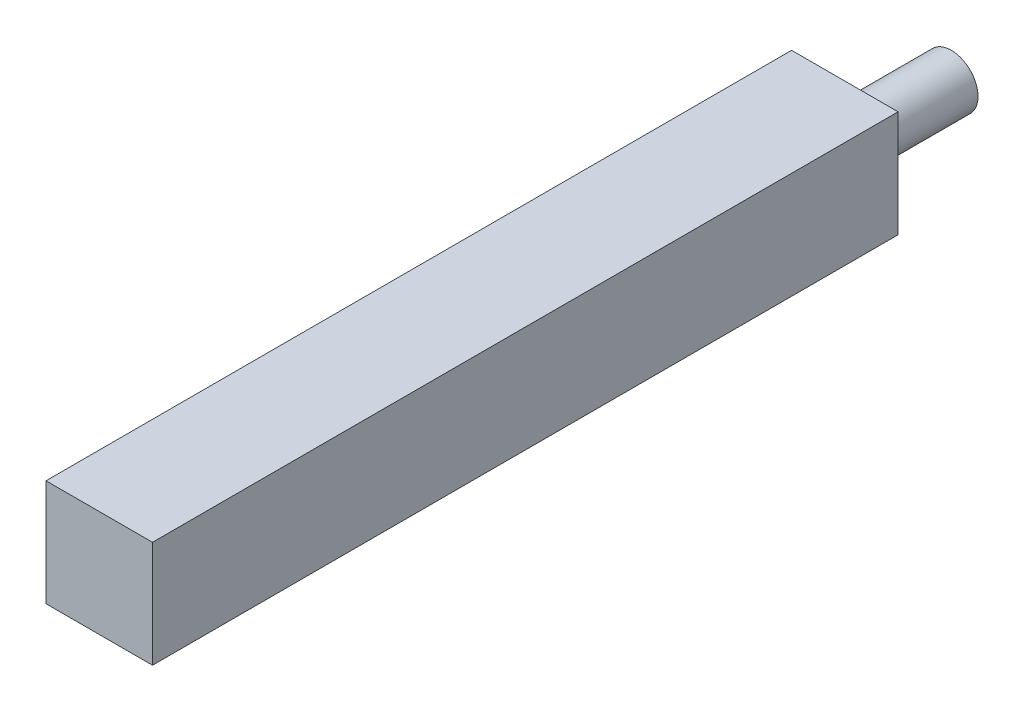
ISO-10303-21;
HEADER;
FILE_DESCRIPTION(('STEP AP214'),'2;1');
FILE_NAME('part.step','',(''),(''),'','','');
FILE_SCHEMA(('AUTOMOTIVE_DESIGN { 1 0 10303 214 1 1 1 1 }'));
ENDSEC;
DATA;
#1=APPLICATION_CONTEXT('core data for automotive mechanical design processes');
#2=APPLICATION_PROTOCOL_DEFINITION('international standard','automotive_design',2000,#1);
#3=PRODUCT_CONTEXT('',#1,'mechanical');
#4=PRODUCT('Part','Part','',(#3));
#5=PRODUCT_RELATED_PRODUCT_CATEGORY('part','',(#4));
#6=PRODUCT_DEFINITION_FORMATION('','',#4);
#7=PRODUCT_DEFINITION_CONTEXT('part definition',#1,'design');
#8=PRODUCT_DEFINITION('design','',#6,#7);
#9=PRODUCT_DEFINITION_SHAPE('','',#8);
#10=(LENGTH_UNIT() NAMED_UNIT(*) SI_UNIT(.MILLI.,.METRE.));
#11=(NAMED_UNIT(*) PLANE_ANGLE_UNIT() SI_UNIT($,.RADIAN.));
#12=(NAMED_UNIT(*) SI_UNIT($,.STERADIAN.) SOLID_ANGLE_UNIT());
#13=UNCERTAINTY_MEASURE_WITH_UNIT(LENGTH_MEASURE(1.E-05),#10,'distance_accuracy_value','');
#14=(GEOMETRIC_REPRESENTATION_CONTEXT(3) GLOBAL_UNCERTAINTY_ASSIGNED_CONTEXT((#13)) GLOBAL_UNIT_ASSIGNED_CONTEXT((#10,
#11,#12)) REPRESENTATION_CONTEXT('',''));
#15=CARTESIAN_POINT('',(0.,0.,0.));
#16=DIRECTION('',(0.,0.,1.));
#17=DIRECTION('',(1.,0.,0.));
#18=AXIS2_PLACEMENT_3D('',#15,#16,#17);
#19=CARTESIAN_POINT('',(0.,100.,700.));
#20=DIRECTION('',(1.,0.,0.));
#21=DIRECTION('',(0.,1.,0.));
#22=AXIS2_PLACEMENT_3D('',#19,#20,#21);
#23=PLANE('',#22);
#24=DIRECTION('',(0.,-1.,0.));
#25=VECTOR('',#24,1.);
#26=CARTESIAN_POINT('',(0.,100.,0.));
#27=LINE('',#26,#25);
#28=CARTESIAN_POINT('',(0.,100.,0.));
#29=VERTEX_POINT('',#28);
#30=CARTESIAN_POINT('',(0.,0.,0.));
#31=VERTEX_POINT('',#30);
#32=EDGE_CURVE('E113',#29,#31,#27,.T.);
#33=ORIENTED_EDGE('',*,*,#32,.T.);
#34=DIRECTION('',(0.,0.,-1.));
#35=VECTOR('',#34,1.);
#36=CARTESIAN_POINT('',(0.,0.,700.));
#37=LINE('',#36,#35);
#38=CARTESIAN_POINT('',(0.,0.,700.));
#39=VERTEX_POINT('',#38);
#40=EDGE_CURVE('E11',#39,#31,#37,.T.);
#41=ORIENTED_EDGE('',*,*,#40,.F.);
#42=DIRECTION('',(0.,-1.,0.));
#43=VECTOR('',#42,1.);
#44=CARTESIAN_POINT('',(0.,100.,700.));
#45=LINE('',#44,#43);
#46=CARTESIAN_POINT('',(0.,100.,700.));
#47=VERTEX_POINT('',#46);
#48=EDGE_CURVE('E97',#47,#39,#45,.T.);
#49=ORIENTED_EDGE('',*,*,#48,.F.);
#50=DIRECTION('',(0.,0.,-1.));
#51=VECTOR('',#50,1.);
#52=CARTESIAN_POINT('',(0.,100.,700.));
#53=LINE('',#52,#51);
#54=EDGE_CURVE('E109',#47,#29,#53,.T.);
#55=ORIENTED_EDGE('',*,*,#54,.T.);
#56=EDGE_LOOP('',(#33,#41,#49,#55));
#57=FACE_BOUND('',#56,.T.);
#58=ADVANCED_FACE('F45',(#57),#23,.F.);
#59=CARTESIAN_POINT('',(0.,0.,700.));
#60=DIRECTION('',(0.,1.,0.));
#61=DIRECTION('',(0.,0.,1.));
#62=AXIS2_PLACEMENT_3D('',#59,#60,#61);
#63=PLANE('',#62);
#64=DIRECTION('',(1.,0.,0.));
#65=VECTOR('',#64,1.);
#66=CARTESIAN_POINT('',(0.,0.,0.));
#67=LINE('',#66,#65);
#68=CARTESIAN_POINT('',(100.,0.,0.));
#69=VERTEX_POINT('',#68);
#70=EDGE_CURVE('E102',#31,#69,#67,.T.);
#71=ORIENTED_EDGE('',*,*,#70,.T.);
#72=DIRECTION('',(0.,0.,-1.));
#73=VECTOR('',#72,1.);
#74=CARTESIAN_POINT('',(100.,0.,700.));
#75=LINE('',#74,#73);
#76=CARTESIAN_POINT('',(100.,0.,700.));
#77=VERTEX_POINT('',#76);
#78=EDGE_CURVE('E54',#77,#69,#75,.T.);
#79=ORIENTED_EDGE('',*,*,#78,.F.);
#80=DIRECTION('',(1.,0.,0.));
#81=VECTOR('',#80,1.);
#82=CARTESIAN_POINT('',(0.,0.,700.));
#83=LINE('',#82,#81);
#84=EDGE_CURVE('E92',#39,#77,#83,.T.);
#85=ORIENTED_EDGE('',*,*,#84,.F.);
#86=ORIENTED_EDGE('',*,*,#40,.T.);
#87=EDGE_LOOP('',(#71,#79,#85,#86));
#88=FACE_BOUND('',#87,.T.);
#89=ADVANCED_FACE('F101',(#88),#63,.F.);
#90=CARTESIAN_POINT('',(100.,0.,700.));
#91=DIRECTION('',(-1.,0.,0.));
#92=DIRECTION('',(0.,-1.,0.));
#93=AXIS2_PLACEMENT_3D('',#90,#91,#92);
#94=PLANE('',#93);
#95=DIRECTION('',(0.,1.,0.));
#96=VECTOR('',#95,1.);
#97=CARTESIAN_POINT('',(100.,0.,0.));
#98=LINE('',#97,#96);
#99=CARTESIAN_POINT('',(100.,100.,0.));
#100=VERTEX_POINT('',#99);
#101=EDGE_CURVE('E79',#69,#100,#98,.T.);
#102=ORIENTED_EDGE('',*,*,#101,.T.);
#103=DIRECTION('',(0.,0.,-1.));
#104=VECTOR('',#103,1.);
#105=CARTESIAN_POINT('',(100.,100.,700.));
#106=LINE('',#105,#104);
#107=CARTESIAN_POINT('',(100.,100.,700.));
#108=VERTEX_POINT('',#107);
#109=EDGE_CURVE('E104',#108,#100,#106,.T.);
#110=ORIENTED_EDGE('',*,*,#109,.F.);
#111=DIRECTION('',(0.,1.,0.));
#112=VECTOR('',#111,1.);
#113=CARTESIAN_POINT('',(100.,0.,700.));
#114=LINE('',#113,#112);
#115=EDGE_CURVE('E95',#77,#108,#114,.T.);
#116=ORIENTED_EDGE('',*,*,#115,.F.);
#117=ORIENTED_EDGE('',*,*,#78,.T.);
#118=EDGE_LOOP('',(#102,#110,#116,#117));
#119=FACE_BOUND('',#118,.T.);
#120=ADVANCED_FACE('F105',(#119),#94,.F.);
#121=CARTESIAN_POINT('',(100.,100.,700.));
#122=DIRECTION('',(0.,-1.,0.));
#123=DIRECTION('',(0.,0.,-1.));
#124=AXIS2_PLACEMENT_3D('',#121,#122,#123);
#125=PLANE('',#124);
#126=DIRECTION('',(-1.,0.,0.));
#127=VECTOR('',#126,1.);
#128=CARTESIAN_POINT('',(100.,100.,0.));
#129=LINE('',#128,#127);
#130=EDGE_CURVE('E85',#100,#29,#129,.T.);
#131=ORIENTED_EDGE('',*,*,#130,.T.);
#132=ORIENTED_EDGE('',*,*,#54,.F.);
#133=DIRECTION('',(-1.,0.,0.));
#134=VECTOR('',#133,1.);
#135=CARTESIAN_POINT('',(100.,100.,700.));
#136=LINE('',#135,#134);
#137=EDGE_CURVE('E62',#108,#47,#136,.T.);
#138=ORIENTED_EDGE('',*,*,#137,.F.);
#139=ORIENTED_EDGE('',*,*,#109,.T.);
#140=EDGE_LOOP('',(#131,#132,#138,#139));
#141=FACE_BOUND('',#140,.T.);
#142=ADVANCED_FACE('F127',(#141),#125,.F.);
#143=CARTESIAN_POINT('',(0.,0.,700.));
#144=DIRECTION('',(0.,0.,1.));
#145=DIRECTION('',(1.,0.,0.));
#146=AXIS2_PLACEMENT_3D('',#143,#144,#145);
#147=PLANE('',#146);
#148=ORIENTED_EDGE('',*,*,#48,.T.);
#149=ORIENTED_EDGE('',*,*,#84,.T.);
#150=ORIENTED_EDGE('',*,*,#115,.T.);
#151=ORIENTED_EDGE('',*,*,#137,.T.);
#152=EDGE_LOOP('',(#148,#149,#150,#151));
#153=FACE_BOUND('',#152,.T.);
#154=ADVANCED_FACE('F93',(#153),#147,.T.);
#155=CARTESIAN_POINT('',(0.,0.,0.));
#156=DIRECTION('',(0.,0.,1.));
#157=DIRECTION('',(1.,0.,0.));
#158=AXIS2_PLACEMENT_3D('',#155,#156,#157);
#159=PLANE('',#158);
#160=CARTESIAN_POINT('',(50.,50.,0.));
#161=DIRECTION('',(0.,0.,1.));
#162=DIRECTION('',(1.,0.,0.));
#163=AXIS2_PLACEMENT_3D('',#160,#161,#162);
#164=CIRCLE('',#163,25.);
#165=CARTESIAN_POINT('',(75.,50.,0.));
#166=VERTEX_POINT('',#165);
#167=EDGE_CURVE('E134',#166,#166,#164,.T.);
#168=ORIENTED_EDGE('',*,*,#167,.T.);
#169=EDGE_LOOP('',(#168));
#170=FACE_BOUND('',#169,.T.);
#171=ORIENTED_EDGE('',*,*,#32,.F.);
#172=ORIENTED_EDGE('',*,*,#130,.F.);
#173=ORIENTED_EDGE('',*,*,#101,.F.);
#174=ORIENTED_EDGE('',*,*,#70,.F.);
#175=EDGE_LOOP('',(#171,#172,#173,#174));
#176=FACE_BOUND('',#175,.T.);
#177=ADVANCED_FACE('F130',(#170,#176),#159,.F.);
#178=CARTESIAN_POINT('',(50.,50.,-100.));
#179=DIRECTION('',(0.,0.,1.));
#180=DIRECTION('',(1.,0.,0.));
#181=AXIS2_PLACEMENT_3D('',#178,#179,#180);
#182=CYLINDRICAL_SURFACE('',#181,25.);
#183=CARTESIAN_POINT('',(50.,50.,-100.));
#184=DIRECTION('',(0.,0.,1.));
#185=DIRECTION('',(1.,0.,0.));
#186=AXIS2_PLACEMENT_3D('',#183,#184,#185);
#187=CIRCLE('',#186,25.);
#188=CARTESIAN_POINT('',(75.,50.,-100.));
#189=VERTEX_POINT('',#188);
#190=EDGE_CURVE('E117',#189,#189,#187,.T.);
#191=ORIENTED_EDGE('',*,*,#190,.T.);
#192=EDGE_LOOP('',(#191));
#193=FACE_BOUND('',#192,.T.);
#194=ORIENTED_EDGE('',*,*,#167,.F.);
#195=EDGE_LOOP('',(#194));
#196=FACE_BOUND('',#195,.T.);
#197=ADVANCED_FACE('F142',(#193,#196),#182,.T.);
#198=CARTESIAN_POINT('',(50.,50.,-100.));
#199=DIRECTION('',(0.,0.,1.));
#200=DIRECTION('',(1.,0.,0.));
#201=AXIS2_PLACEMENT_3D('',#198,#199,#200);
#202=PLANE('',#201);
#203=ORIENTED_EDGE('',*,*,#190,.F.);
#204=EDGE_LOOP('',(#203));
#205=FACE_BOUND('',#204,.T.);
#206=ADVANCED_FACE('F145',(#205),#202,.F.);
#207=CLOSED_SHELL('',(#58,#89,#120,#142,#154,#177,#197,#206));
#208=MANIFOLD_SOLID_BREP('B2',#207);
#209=ADVANCED_BREP_SHAPE_REPRESENTATION('',(#18,#208),#14);
#210=SHAPE_DEFINITION_REPRESENTATION(#9,#209);
ENDSEC;
END-ISO-10303-21;
